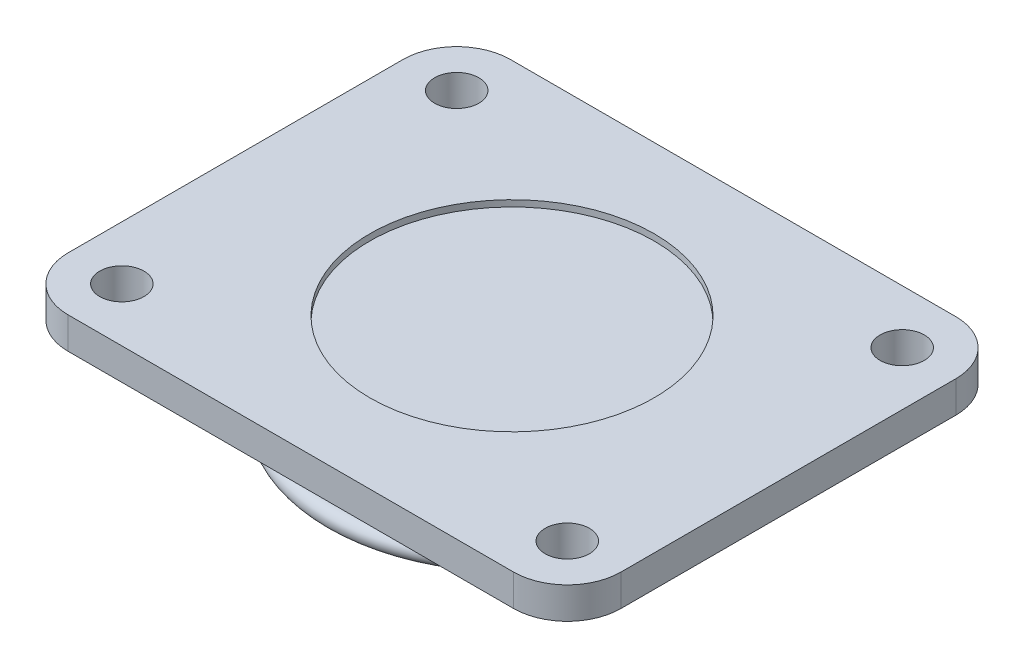
ISO-10303-21;
HEADER;
FILE_DESCRIPTION(('STEP AP214'),'2;1');
FILE_NAME('part.step','',(''),(''),'','','');
FILE_SCHEMA(('AUTOMOTIVE_DESIGN { 1 0 10303 214 1 1 1 1 }'));
ENDSEC;
DATA;
#1=APPLICATION_CONTEXT('core data for automotive mechanical design processes');
#2=APPLICATION_PROTOCOL_DEFINITION('international standard','automotive_design',2000,#1);
#3=PRODUCT_CONTEXT('',#1,'mechanical');
#4=PRODUCT('Part','Part','',(#3));
#5=PRODUCT_RELATED_PRODUCT_CATEGORY('part','',(#4));
#6=PRODUCT_DEFINITION_FORMATION('','',#4);
#7=PRODUCT_DEFINITION_CONTEXT('part definition',#1,'design');
#8=PRODUCT_DEFINITION('design','',#6,#7);
#9=PRODUCT_DEFINITION_SHAPE('','',#8);
#10=(LENGTH_UNIT() NAMED_UNIT(*) SI_UNIT(.MILLI.,.METRE.));
#11=(NAMED_UNIT(*) PLANE_ANGLE_UNIT() SI_UNIT($,.RADIAN.));
#12=(NAMED_UNIT(*) SI_UNIT($,.STERADIAN.) SOLID_ANGLE_UNIT());
#13=UNCERTAINTY_MEASURE_WITH_UNIT(LENGTH_MEASURE(1.E-05),#10,'distance_accuracy_value','');
#14=(GEOMETRIC_REPRESENTATION_CONTEXT(3) GLOBAL_UNCERTAINTY_ASSIGNED_CONTEXT((#13)) GLOBAL_UNIT_ASSIGNED_CONTEXT((#10,
#11,#12)) REPRESENTATION_CONTEXT('',''));
#15=CARTESIAN_POINT('',(0.,0.,0.));
#16=DIRECTION('',(0.,0.,1.));
#17=DIRECTION('',(1.,0.,0.));
#18=AXIS2_PLACEMENT_3D('',#15,#16,#17);
#19=CARTESIAN_POINT('',(-70.5,10.,53.));
#20=DIRECTION('',(0.,-1.,0.));
#21=DIRECTION('',(0.,0.,-1.));
#22=AXIS2_PLACEMENT_3D('',#19,#20,#21);
#23=PLANE('',#22);
#24=CARTESIAN_POINT('',(0.,10.,0.));
#25=DIRECTION('',(0.,1.,0.));
#26=DIRECTION('',(0.,0.,1.));
#27=AXIS2_PLACEMENT_3D('',#24,#25,#26);
#28=CIRCLE('',#27,45.);
#29=CARTESIAN_POINT('',(0.,10.,45.));
#30=VERTEX_POINT('',#29);
#31=EDGE_CURVE('E256',#30,#30,#28,.T.);
#32=ORIENTED_EDGE('',*,*,#31,.F.);
#33=EDGE_LOOP('',(#32));
#34=FACE_BOUND('',#33,.T.);
#35=CARTESIAN_POINT('',(-70.5,10.,53.));
#36=DIRECTION('',(0.,1.,0.));
#37=DIRECTION('',(0.,0.,-1.));
#38=AXIS2_PLACEMENT_3D('',#35,#36,#37);
#39=CIRCLE('',#38,17.);
#40=CARTESIAN_POINT('',(-87.5,10.,52.9999999999999));
#41=VERTEX_POINT('',#40);
#42=CARTESIAN_POINT('',(-70.4999999999999,10.,70.));
#43=VERTEX_POINT('',#42);
#44=EDGE_CURVE('E148',#41,#43,#39,.T.);
#45=ORIENTED_EDGE('',*,*,#44,.T.);
#46=DIRECTION('',(1.,0.,0.));
#47=VECTOR('',#46,1.);
#48=CARTESIAN_POINT('',(-70.4999999999999,10.,70.));
#49=LINE('',#48,#47);
#50=CARTESIAN_POINT('',(70.4999999999999,10.,70.));
#51=VERTEX_POINT('',#50);
#52=EDGE_CURVE('E96',#43,#51,#49,.T.);
#53=ORIENTED_EDGE('',*,*,#52,.T.);
#54=CARTESIAN_POINT('',(70.5,10.,53.));
#55=DIRECTION('',(0.,1.,0.));
#56=DIRECTION('',(0.,0.,1.));
#57=AXIS2_PLACEMENT_3D('',#54,#55,#56);
#58=CIRCLE('',#57,17.);
#59=CARTESIAN_POINT('',(87.5,10.,52.9999999999999));
#60=VERTEX_POINT('',#59);
#61=EDGE_CURVE('E224',#51,#60,#58,.T.);
#62=ORIENTED_EDGE('',*,*,#61,.T.);
#63=DIRECTION('',(0.,0.,-1.));
#64=VECTOR('',#63,1.);
#65=CARTESIAN_POINT('',(87.5,10.,52.9999999999999));
#66=LINE('',#65,#64);
#67=CARTESIAN_POINT('',(87.5,10.,-52.9999999999999));
#68=VERTEX_POINT('',#67);
#69=EDGE_CURVE('E226',#60,#68,#66,.T.);
#70=ORIENTED_EDGE('',*,*,#69,.T.);
#71=CARTESIAN_POINT('',(70.5,10.,-53.));
#72=DIRECTION('',(0.,1.,0.));
#73=DIRECTION('',(0.,0.,-1.));
#74=AXIS2_PLACEMENT_3D('',#71,#72,#73);
#75=CIRCLE('',#74,17.);
#76=CARTESIAN_POINT('',(70.4999999999999,10.,-70.));
#77=VERTEX_POINT('',#76);
#78=EDGE_CURVE('E115',#68,#77,#75,.T.);
#79=ORIENTED_EDGE('',*,*,#78,.T.);
#80=DIRECTION('',(-1.,0.,0.));
#81=VECTOR('',#80,1.);
#82=CARTESIAN_POINT('',(-70.4999999999999,10.,-70.));
#83=LINE('',#82,#81);
#84=CARTESIAN_POINT('',(-70.4999999999999,10.,-70.));
#85=VERTEX_POINT('',#84);
#86=EDGE_CURVE('E109',#77,#85,#83,.T.);
#87=ORIENTED_EDGE('',*,*,#86,.T.);
#88=CARTESIAN_POINT('',(-70.5,10.,-53.));
#89=DIRECTION('',(0.,1.,0.));
#90=DIRECTION('',(0.,0.,-1.));
#91=AXIS2_PLACEMENT_3D('',#88,#89,#90);
#92=CIRCLE('',#91,17.);
#93=CARTESIAN_POINT('',(-87.5,10.,-52.9999999999999));
#94=VERTEX_POINT('',#93);
#95=EDGE_CURVE('E113',#85,#94,#92,.T.);
#96=ORIENTED_EDGE('',*,*,#95,.T.);
#97=DIRECTION('',(0.,0.,1.));
#98=VECTOR('',#97,1.);
#99=CARTESIAN_POINT('',(-87.5,10.,52.9999999999999));
#100=LINE('',#99,#98);
#101=EDGE_CURVE('E52',#94,#41,#100,.T.);
#102=ORIENTED_EDGE('',*,*,#101,.T.);
#103=EDGE_LOOP('',(#45,#53,#62,#70,#79,#87,#96,#102));
#104=FACE_BOUND('',#103,.T.);
#105=CARTESIAN_POINT('',(70.5,10.,53.));
#106=DIRECTION('',(0.,1.,0.));
#107=DIRECTION('',(0.,0.,1.));
#108=AXIS2_PLACEMENT_3D('',#105,#106,#107);
#109=CIRCLE('',#108,7.);
#110=CARTESIAN_POINT('',(70.5,10.,60.));
#111=VERTEX_POINT('',#110);
#112=EDGE_CURVE('E137',#111,#111,#109,.T.);
#113=ORIENTED_EDGE('',*,*,#112,.F.);
#114=EDGE_LOOP('',(#113));
#115=FACE_BOUND('',#114,.T.);
#116=CARTESIAN_POINT('',(70.5,10.,-53.));
#117=DIRECTION('',(0.,1.,0.));
#118=DIRECTION('',(0.,0.,1.));
#119=AXIS2_PLACEMENT_3D('',#116,#117,#118);
#120=CIRCLE('',#119,7.);
#121=CARTESIAN_POINT('',(70.5,10.,-46.));
#122=VERTEX_POINT('',#121);
#123=EDGE_CURVE('E235',#122,#122,#120,.T.);
#124=ORIENTED_EDGE('',*,*,#123,.F.);
#125=EDGE_LOOP('',(#124));
#126=FACE_BOUND('',#125,.T.);
#127=CARTESIAN_POINT('',(-70.5,10.,-53.));
#128=DIRECTION('',(0.,1.,0.));
#129=DIRECTION('',(0.,0.,1.));
#130=AXIS2_PLACEMENT_3D('',#127,#128,#129);
#131=CIRCLE('',#130,7.);
#132=CARTESIAN_POINT('',(-70.5,10.,-46.));
#133=VERTEX_POINT('',#132);
#134=EDGE_CURVE('E241',#133,#133,#131,.T.);
#135=ORIENTED_EDGE('',*,*,#134,.F.);
#136=EDGE_LOOP('',(#135));
#137=FACE_BOUND('',#136,.T.);
#138=CARTESIAN_POINT('',(-70.5,10.,53.));
#139=DIRECTION('',(0.,1.,0.));
#140=DIRECTION('',(0.,0.,1.));
#141=AXIS2_PLACEMENT_3D('',#138,#139,#140);
#142=CIRCLE('',#141,7.);
#143=CARTESIAN_POINT('',(-70.5,10.,60.));
#144=VERTEX_POINT('',#143);
#145=EDGE_CURVE('E247',#144,#144,#142,.T.);
#146=ORIENTED_EDGE('',*,*,#145,.F.);
#147=EDGE_LOOP('',(#146));
#148=FACE_BOUND('',#147,.T.);
#149=ADVANCED_FACE('F35',(#34,#104,#115,#126,#137,#148),#23,.F.);
#150=CARTESIAN_POINT('',(-70.5,0.,53.));
#151=DIRECTION('',(0.,-1.,0.));
#152=DIRECTION('',(0.,0.,-1.));
#153=AXIS2_PLACEMENT_3D('',#150,#151,#152);
#154=PLANE('',#153);
#155=CARTESIAN_POINT('',(0.,0.,0.));
#156=DIRECTION('',(0.,-1.,0.));
#157=DIRECTION('',(0.,0.,-1.));
#158=AXIS2_PLACEMENT_3D('',#155,#156,#157);
#159=CIRCLE('',#158,56.);
#160=CARTESIAN_POINT('',(0.,0.,-56.));
#161=VERTEX_POINT('',#160);
#162=EDGE_CURVE('E259',#161,#161,#159,.T.);
#163=ORIENTED_EDGE('',*,*,#162,.F.);
#164=EDGE_LOOP('',(#163));
#165=FACE_BOUND('',#164,.T.);
#166=CARTESIAN_POINT('',(-70.5,0.,-53.));
#167=DIRECTION('',(0.,1.,0.));
#168=DIRECTION('',(0.,0.,1.));
#169=AXIS2_PLACEMENT_3D('',#166,#167,#168);
#170=CIRCLE('',#169,7.);
#171=CARTESIAN_POINT('',(-70.5,0.,-46.));
#172=VERTEX_POINT('',#171);
#173=EDGE_CURVE('E244',#172,#172,#170,.T.);
#174=ORIENTED_EDGE('',*,*,#173,.T.);
#175=EDGE_LOOP('',(#174));
#176=FACE_BOUND('',#175,.T.);
#177=CARTESIAN_POINT('',(70.5,0.,53.));
#178=DIRECTION('',(0.,1.,0.));
#179=DIRECTION('',(0.,0.,1.));
#180=AXIS2_PLACEMENT_3D('',#177,#178,#179);
#181=CIRCLE('',#180,7.);
#182=CARTESIAN_POINT('',(70.5,0.,60.));
#183=VERTEX_POINT('',#182);
#184=EDGE_CURVE('E232',#183,#183,#181,.T.);
#185=ORIENTED_EDGE('',*,*,#184,.T.);
#186=EDGE_LOOP('',(#185));
#187=FACE_BOUND('',#186,.T.);
#188=CARTESIAN_POINT('',(-70.5,0.,53.));
#189=DIRECTION('',(0.,1.,0.));
#190=DIRECTION('',(0.,0.,-1.));
#191=AXIS2_PLACEMENT_3D('',#188,#189,#190);
#192=CIRCLE('',#191,17.);
#193=CARTESIAN_POINT('',(-87.5,0.,52.9999999999999));
#194=VERTEX_POINT('',#193);
#195=CARTESIAN_POINT('',(-70.4999999999999,0.,70.));
#196=VERTEX_POINT('',#195);
#197=EDGE_CURVE('E133',#194,#196,#192,.T.);
#198=ORIENTED_EDGE('',*,*,#197,.F.);
#199=DIRECTION('',(0.,0.,1.));
#200=VECTOR('',#199,1.);
#201=CARTESIAN_POINT('',(-87.5,0.,52.9999999999999));
#202=LINE('',#201,#200);
#203=CARTESIAN_POINT('',(-87.5,0.,-52.9999999999999));
#204=VERTEX_POINT('',#203);
#205=EDGE_CURVE('E87',#204,#194,#202,.T.);
#206=ORIENTED_EDGE('',*,*,#205,.F.);
#207=CARTESIAN_POINT('',(-70.5,0.,-53.));
#208=DIRECTION('',(0.,1.,0.));
#209=DIRECTION('',(0.,0.,-1.));
#210=AXIS2_PLACEMENT_3D('',#207,#208,#209);
#211=CIRCLE('',#210,17.);
#212=CARTESIAN_POINT('',(-70.4999999999999,0.,-70.));
#213=VERTEX_POINT('',#212);
#214=EDGE_CURVE('E81',#213,#204,#211,.T.);
#215=ORIENTED_EDGE('',*,*,#214,.F.);
#216=DIRECTION('',(-1.,0.,0.));
#217=VECTOR('',#216,1.);
#218=CARTESIAN_POINT('',(-70.4999999999999,0.,-70.));
#219=LINE('',#218,#217);
#220=CARTESIAN_POINT('',(70.4999999999999,0.,-70.));
#221=VERTEX_POINT('',#220);
#222=EDGE_CURVE('E123',#221,#213,#219,.T.);
#223=ORIENTED_EDGE('',*,*,#222,.F.);
#224=CARTESIAN_POINT('',(70.5,0.,-53.));
#225=DIRECTION('',(0.,1.,0.));
#226=DIRECTION('',(0.,0.,-1.));
#227=AXIS2_PLACEMENT_3D('',#224,#225,#226);
#228=CIRCLE('',#227,17.);
#229=CARTESIAN_POINT('',(87.5,0.,-52.9999999999999));
#230=VERTEX_POINT('',#229);
#231=EDGE_CURVE('E143',#230,#221,#228,.T.);
#232=ORIENTED_EDGE('',*,*,#231,.F.);
#233=DIRECTION('',(0.,0.,-1.));
#234=VECTOR('',#233,1.);
#235=CARTESIAN_POINT('',(87.5,0.,52.9999999999999));
#236=LINE('',#235,#234);
#237=CARTESIAN_POINT('',(87.5,0.,52.9999999999999));
#238=VERTEX_POINT('',#237);
#239=EDGE_CURVE('E141',#238,#230,#236,.T.);
#240=ORIENTED_EDGE('',*,*,#239,.F.);
#241=CARTESIAN_POINT('',(70.5,0.,53.));
#242=DIRECTION('',(0.,1.,0.));
#243=DIRECTION('',(0.,0.,1.));
#244=AXIS2_PLACEMENT_3D('',#241,#242,#243);
#245=CIRCLE('',#244,17.);
#246=CARTESIAN_POINT('',(70.4999999999999,0.,70.));
#247=VERTEX_POINT('',#246);
#248=EDGE_CURVE('E139',#247,#238,#245,.T.);
#249=ORIENTED_EDGE('',*,*,#248,.F.);
#250=DIRECTION('',(1.,0.,0.));
#251=VECTOR('',#250,1.);
#252=CARTESIAN_POINT('',(-70.4999999999999,0.,70.));
#253=LINE('',#252,#251);
#254=EDGE_CURVE('E136',#196,#247,#253,.T.);
#255=ORIENTED_EDGE('',*,*,#254,.F.);
#256=EDGE_LOOP('',(#198,#206,#215,#223,#232,#240,#249,#255));
#257=FACE_BOUND('',#256,.T.);
#258=CARTESIAN_POINT('',(70.5,0.,-53.));
#259=DIRECTION('',(0.,1.,0.));
#260=DIRECTION('',(0.,0.,1.));
#261=AXIS2_PLACEMENT_3D('',#258,#259,#260);
#262=CIRCLE('',#261,7.);
#263=CARTESIAN_POINT('',(70.5,0.,-46.));
#264=VERTEX_POINT('',#263);
#265=EDGE_CURVE('E238',#264,#264,#262,.T.);
#266=ORIENTED_EDGE('',*,*,#265,.T.);
#267=EDGE_LOOP('',(#266));
#268=FACE_BOUND('',#267,.T.);
#269=CARTESIAN_POINT('',(-70.5,0.,53.));
#270=DIRECTION('',(0.,1.,0.));
#271=DIRECTION('',(0.,0.,1.));
#272=AXIS2_PLACEMENT_3D('',#269,#270,#271);
#273=CIRCLE('',#272,7.);
#274=CARTESIAN_POINT('',(-70.5,0.,60.));
#275=VERTEX_POINT('',#274);
#276=EDGE_CURVE('E250',#275,#275,#273,.T.);
#277=ORIENTED_EDGE('',*,*,#276,.T.);
#278=EDGE_LOOP('',(#277));
#279=FACE_BOUND('',#278,.T.);
#280=ADVANCED_FACE('F176',(#165,#176,#187,#257,#268,#279),#154,.T.);
#281=CARTESIAN_POINT('',(-70.5,10.,53.));
#282=DIRECTION('',(0.,-1.,0.));
#283=DIRECTION('',(0.,0.,-1.));
#284=AXIS2_PLACEMENT_3D('',#281,#282,#283);
#285=CYLINDRICAL_SURFACE('',#284,17.);
#286=ORIENTED_EDGE('',*,*,#197,.T.);
#287=DIRECTION('',(0.,-1.,0.));
#288=VECTOR('',#287,1.);
#289=CARTESIAN_POINT('',(-70.4999999999999,10.,70.));
#290=LINE('',#289,#288);
#291=EDGE_CURVE('E161',#43,#196,#290,.T.);
#292=ORIENTED_EDGE('',*,*,#291,.F.);
#293=ORIENTED_EDGE('',*,*,#44,.F.);
#294=DIRECTION('',(0.,-1.,0.));
#295=VECTOR('',#294,1.);
#296=CARTESIAN_POINT('',(-87.5,10.,52.9999999999999));
#297=LINE('',#296,#295);
#298=EDGE_CURVE('E129',#41,#194,#297,.T.);
#299=ORIENTED_EDGE('',*,*,#298,.T.);
#300=EDGE_LOOP('',(#286,#292,#293,#299));
#301=FACE_BOUND('',#300,.T.);
#302=ADVANCED_FACE('F182',(#301),#285,.T.);
#303=CARTESIAN_POINT('',(-70.4999999999999,10.,70.));
#304=DIRECTION('',(0.,0.,-1.));
#305=DIRECTION('',(-1.,0.,0.));
#306=AXIS2_PLACEMENT_3D('',#303,#304,#305);
#307=PLANE('',#306);
#308=ORIENTED_EDGE('',*,*,#254,.T.);
#309=DIRECTION('',(0.,-1.,0.));
#310=VECTOR('',#309,1.);
#311=CARTESIAN_POINT('',(70.4999999999999,10.,70.));
#312=LINE('',#311,#310);
#313=EDGE_CURVE('E158',#51,#247,#312,.T.);
#314=ORIENTED_EDGE('',*,*,#313,.F.);
#315=ORIENTED_EDGE('',*,*,#52,.F.);
#316=ORIENTED_EDGE('',*,*,#291,.T.);
#317=EDGE_LOOP('',(#308,#314,#315,#316));
#318=FACE_BOUND('',#317,.T.);
#319=ADVANCED_FACE('F208',(#318),#307,.F.);
#320=CARTESIAN_POINT('',(70.5,10.,53.));
#321=DIRECTION('',(0.,-1.,0.));
#322=DIRECTION('',(0.,0.,-1.));
#323=AXIS2_PLACEMENT_3D('',#320,#321,#322);
#324=CYLINDRICAL_SURFACE('',#323,17.);
#325=ORIENTED_EDGE('',*,*,#248,.T.);
#326=DIRECTION('',(0.,-1.,0.));
#327=VECTOR('',#326,1.);
#328=CARTESIAN_POINT('',(87.5,10.,52.9999999999999));
#329=LINE('',#328,#327);
#330=EDGE_CURVE('E155',#60,#238,#329,.T.);
#331=ORIENTED_EDGE('',*,*,#330,.F.);
#332=ORIENTED_EDGE('',*,*,#61,.F.);
#333=ORIENTED_EDGE('',*,*,#313,.T.);
#334=EDGE_LOOP('',(#325,#331,#332,#333));
#335=FACE_BOUND('',#334,.T.);
#336=ADVANCED_FACE('F204',(#335),#324,.T.);
#337=CARTESIAN_POINT('',(87.5,10.,52.9999999999999));
#338=DIRECTION('',(-1.,0.,0.));
#339=DIRECTION('',(0.,0.,1.));
#340=AXIS2_PLACEMENT_3D('',#337,#338,#339);
#341=PLANE('',#340);
#342=ORIENTED_EDGE('',*,*,#239,.T.);
#343=DIRECTION('',(0.,-1.,0.));
#344=VECTOR('',#343,1.);
#345=CARTESIAN_POINT('',(87.5,10.,-52.9999999999999));
#346=LINE('',#345,#344);
#347=EDGE_CURVE('E152',#68,#230,#346,.T.);
#348=ORIENTED_EDGE('',*,*,#347,.F.);
#349=ORIENTED_EDGE('',*,*,#69,.F.);
#350=ORIENTED_EDGE('',*,*,#330,.T.);
#351=EDGE_LOOP('',(#342,#348,#349,#350));
#352=FACE_BOUND('',#351,.T.);
#353=ADVANCED_FACE('F200',(#352),#341,.F.);
#354=CARTESIAN_POINT('',(70.5,10.,-53.));
#355=DIRECTION('',(0.,-1.,0.));
#356=DIRECTION('',(0.,0.,-1.));
#357=AXIS2_PLACEMENT_3D('',#354,#355,#356);
#358=CYLINDRICAL_SURFACE('',#357,17.);
#359=ORIENTED_EDGE('',*,*,#231,.T.);
#360=DIRECTION('',(0.,-1.,0.));
#361=VECTOR('',#360,1.);
#362=CARTESIAN_POINT('',(70.4999999999999,10.,-70.));
#363=LINE('',#362,#361);
#364=EDGE_CURVE('E124',#77,#221,#363,.T.);
#365=ORIENTED_EDGE('',*,*,#364,.F.);
#366=ORIENTED_EDGE('',*,*,#78,.F.);
#367=ORIENTED_EDGE('',*,*,#347,.T.);
#368=EDGE_LOOP('',(#359,#365,#366,#367));
#369=FACE_BOUND('',#368,.T.);
#370=ADVANCED_FACE('F197',(#369),#358,.T.);
#371=CARTESIAN_POINT('',(-70.4999999999999,10.,-70.));
#372=DIRECTION('',(0.,0.,1.));
#373=DIRECTION('',(1.,0.,0.));
#374=AXIS2_PLACEMENT_3D('',#371,#372,#373);
#375=PLANE('',#374);
#376=ORIENTED_EDGE('',*,*,#222,.T.);
#377=DIRECTION('',(0.,-1.,0.));
#378=VECTOR('',#377,1.);
#379=CARTESIAN_POINT('',(-70.4999999999999,10.,-70.));
#380=LINE('',#379,#378);
#381=EDGE_CURVE('E120',#85,#213,#380,.T.);
#382=ORIENTED_EDGE('',*,*,#381,.F.);
#383=ORIENTED_EDGE('',*,*,#86,.F.);
#384=ORIENTED_EDGE('',*,*,#364,.T.);
#385=EDGE_LOOP('',(#376,#382,#383,#384));
#386=FACE_BOUND('',#385,.T.);
#387=ADVANCED_FACE('F121',(#386),#375,.F.);
#388=CARTESIAN_POINT('',(-70.5,10.,-53.));
#389=DIRECTION('',(0.,-1.,0.));
#390=DIRECTION('',(0.,0.,-1.));
#391=AXIS2_PLACEMENT_3D('',#388,#389,#390);
#392=CYLINDRICAL_SURFACE('',#391,17.);
#393=ORIENTED_EDGE('',*,*,#214,.T.);
#394=DIRECTION('',(0.,-1.,0.));
#395=VECTOR('',#394,1.);
#396=CARTESIAN_POINT('',(-87.5,10.,-52.9999999999999));
#397=LINE('',#396,#395);
#398=EDGE_CURVE('E125',#94,#204,#397,.T.);
#399=ORIENTED_EDGE('',*,*,#398,.F.);
#400=ORIENTED_EDGE('',*,*,#95,.F.);
#401=ORIENTED_EDGE('',*,*,#381,.T.);
#402=EDGE_LOOP('',(#393,#399,#400,#401));
#403=FACE_BOUND('',#402,.T.);
#404=ADVANCED_FACE('F127',(#403),#392,.T.);
#405=CARTESIAN_POINT('',(-87.5,10.,52.9999999999999));
#406=DIRECTION('',(1.,0.,0.));
#407=DIRECTION('',(0.,0.,-1.));
#408=AXIS2_PLACEMENT_3D('',#405,#406,#407);
#409=PLANE('',#408);
#410=ORIENTED_EDGE('',*,*,#205,.T.);
#411=ORIENTED_EDGE('',*,*,#298,.F.);
#412=ORIENTED_EDGE('',*,*,#101,.F.);
#413=ORIENTED_EDGE('',*,*,#398,.T.);
#414=EDGE_LOOP('',(#410,#411,#412,#413));
#415=FACE_BOUND('',#414,.T.);
#416=ADVANCED_FACE('F190',(#415),#409,.F.);
#417=CARTESIAN_POINT('',(70.5,10.,53.));
#418=DIRECTION('',(0.,-1.,0.));
#419=DIRECTION('',(0.,0.,-1.));
#420=AXIS2_PLACEMENT_3D('',#417,#418,#419);
#421=CYLINDRICAL_SURFACE('',#420,7.);
#422=ORIENTED_EDGE('',*,*,#112,.T.);
#423=EDGE_LOOP('',(#422));
#424=FACE_BOUND('',#423,.T.);
#425=ORIENTED_EDGE('',*,*,#184,.F.);
#426=EDGE_LOOP('',(#425));
#427=FACE_BOUND('',#426,.T.);
#428=ADVANCED_FACE('F187',(#424,#427),#421,.F.);
#429=CARTESIAN_POINT('',(70.5,10.,-53.));
#430=DIRECTION('',(0.,-1.,0.));
#431=DIRECTION('',(0.,0.,-1.));
#432=AXIS2_PLACEMENT_3D('',#429,#430,#431);
#433=CYLINDRICAL_SURFACE('',#432,7.);
#434=ORIENTED_EDGE('',*,*,#123,.T.);
#435=EDGE_LOOP('',(#434));
#436=FACE_BOUND('',#435,.T.);
#437=ORIENTED_EDGE('',*,*,#265,.F.);
#438=EDGE_LOOP('',(#437));
#439=FACE_BOUND('',#438,.T.);
#440=ADVANCED_FACE('F299',(#436,#439),#433,.F.);
#441=CARTESIAN_POINT('',(-70.5,10.,-53.));
#442=DIRECTION('',(0.,-1.,0.));
#443=DIRECTION('',(0.,0.,-1.));
#444=AXIS2_PLACEMENT_3D('',#441,#442,#443);
#445=CYLINDRICAL_SURFACE('',#444,7.);
#446=ORIENTED_EDGE('',*,*,#134,.T.);
#447=EDGE_LOOP('',(#446));
#448=FACE_BOUND('',#447,.T.);
#449=ORIENTED_EDGE('',*,*,#173,.F.);
#450=EDGE_LOOP('',(#449));
#451=FACE_BOUND('',#450,.T.);
#452=ADVANCED_FACE('F304',(#448,#451),#445,.F.);
#453=CARTESIAN_POINT('',(-70.5,10.,53.));
#454=DIRECTION('',(0.,-1.,0.));
#455=DIRECTION('',(0.,0.,-1.));
#456=AXIS2_PLACEMENT_3D('',#453,#454,#455);
#457=CYLINDRICAL_SURFACE('',#456,7.);
#458=ORIENTED_EDGE('',*,*,#145,.T.);
#459=EDGE_LOOP('',(#458));
#460=FACE_BOUND('',#459,.T.);
#461=ORIENTED_EDGE('',*,*,#276,.F.);
#462=EDGE_LOOP('',(#461));
#463=FACE_BOUND('',#462,.T.);
#464=ADVANCED_FACE('F314',(#460,#463),#457,.F.);
#465=CARTESIAN_POINT('',(0.,8.,0.));
#466=DIRECTION('',(0.,1.,0.));
#467=DIRECTION('',(0.,0.,1.));
#468=AXIS2_PLACEMENT_3D('',#465,#466,#467);
#469=CYLINDRICAL_SURFACE('',#468,45.);
#470=CARTESIAN_POINT('',(0.,8.,0.));
#471=DIRECTION('',(0.,1.,0.));
#472=DIRECTION('',(0.,0.,1.));
#473=AXIS2_PLACEMENT_3D('',#470,#471,#472);
#474=CIRCLE('',#473,45.);
#475=CARTESIAN_POINT('',(0.,8.,45.));
#476=VERTEX_POINT('',#475);
#477=EDGE_CURVE('E253',#476,#476,#474,.T.);
#478=ORIENTED_EDGE('',*,*,#477,.F.);
#479=EDGE_LOOP('',(#478));
#480=FACE_BOUND('',#479,.T.);
#481=ORIENTED_EDGE('',*,*,#31,.T.);
#482=EDGE_LOOP('',(#481));
#483=FACE_BOUND('',#482,.T.);
#484=ADVANCED_FACE('F317',(#480,#483),#469,.F.);
#485=CARTESIAN_POINT('',(0.,8.,0.));
#486=DIRECTION('',(0.,1.,0.));
#487=DIRECTION('',(0.,0.,1.));
#488=AXIS2_PLACEMENT_3D('',#485,#486,#487);
#489=PLANE('',#488);
#490=ORIENTED_EDGE('',*,*,#477,.T.);
#491=EDGE_LOOP('',(#490));
#492=FACE_BOUND('',#491,.T.);
#493=ADVANCED_FACE('F290',(#492),#489,.T.);
#494=CARTESIAN_POINT('',(0.,-20.,0.));
#495=DIRECTION('',(0.,1.,0.));
#496=DIRECTION('',(0.,0.,1.));
#497=AXIS2_PLACEMENT_3D('',#494,#495,#496);
#498=CYLINDRICAL_SURFACE('',#497,56.);
#499=CARTESIAN_POINT('',(0.,-14.,0.));
#500=DIRECTION('',(0.,-1.,0.));
#501=DIRECTION('',(0.,0.,-1.));
#502=AXIS2_PLACEMENT_3D('',#499,#500,#501);
#503=CIRCLE('',#502,56.);
#504=CARTESIAN_POINT('',(0.,-14.,-56.));
#505=VERTEX_POINT('',#504);
#506=EDGE_CURVE('E264',#505,#505,#503,.F.);
#507=ORIENTED_EDGE('',*,*,#506,.T.);
#508=EDGE_LOOP('',(#507));
#509=FACE_BOUND('',#508,.T.);
#510=ORIENTED_EDGE('',*,*,#162,.T.);
#511=EDGE_LOOP('',(#510));
#512=FACE_BOUND('',#511,.T.);
#513=ADVANCED_FACE('F284',(#509,#512),#498,.T.);
#514=CARTESIAN_POINT('',(0.,-17.,0.));
#515=DIRECTION('',(0.,1.,0.));
#516=DIRECTION('',(0.,0.,1.));
#517=AXIS2_PLACEMENT_3D('',#514,#515,#516);
#518=TOROIDAL_SURFACE('',#517,56.,3.);
#519=CARTESIAN_POINT('',(0.,-20.,0.));
#520=DIRECTION('',(0.,1.,0.));
#521=DIRECTION('',(0.,0.,1.));
#522=AXIS2_PLACEMENT_3D('',#519,#520,#521);
#523=CIRCLE('',#522,56.);
#524=CARTESIAN_POINT('',(0.,-20.,56.));
#525=VERTEX_POINT('',#524);
#526=EDGE_CURVE('E267',#525,#525,#523,.T.);
#527=ORIENTED_EDGE('',*,*,#526,.T.);
#528=EDGE_LOOP('',(#527));
#529=FACE_BOUND('',#528,.T.);
#530=ORIENTED_EDGE('',*,*,#506,.F.);
#531=EDGE_LOOP('',(#530));
#532=FACE_BOUND('',#531,.T.);
#533=ADVANCED_FACE('F278',(#529,#532),#518,.T.);
#534=CARTESIAN_POINT('',(0.,-20.,0.));
#535=DIRECTION('',(0.,-1.,0.));
#536=DIRECTION('',(0.,0.,-1.));
#537=AXIS2_PLACEMENT_3D('',#534,#535,#536);
#538=PLANE('',#537);
#539=CARTESIAN_POINT('',(0.,-20.,0.));
#540=DIRECTION('',(0.,-1.,0.));
#541=DIRECTION('',(0.,0.,-1.));
#542=AXIS2_PLACEMENT_3D('',#539,#540,#541);
#543=CIRCLE('',#542,7.5);
#544=CARTESIAN_POINT('',(0.,-20.,-7.5));
#545=VERTEX_POINT('',#544);
#546=EDGE_CURVE('E270',#545,#545,#543,.T.);
#547=ORIENTED_EDGE('',*,*,#546,.F.);
#548=EDGE_LOOP('',(#547));
#549=FACE_BOUND('',#548,.T.);
#550=ORIENTED_EDGE('',*,*,#526,.F.);
#551=EDGE_LOOP('',(#550));
#552=FACE_BOUND('',#551,.T.);
#553=ADVANCED_FACE('F275',(#549,#552),#538,.T.);
#554=CARTESIAN_POINT('',(0.,-45.,0.));
#555=DIRECTION('',(0.,1.,0.));
#556=DIRECTION('',(0.,0.,1.));
#557=AXIS2_PLACEMENT_3D('',#554,#555,#556);
#558=CYLINDRICAL_SURFACE('',#557,7.5);
#559=CARTESIAN_POINT('',(0.,-44.,0.));
#560=DIRECTION('',(0.,-1.,0.));
#561=DIRECTION('',(0.,0.,-1.));
#562=AXIS2_PLACEMENT_3D('',#559,#560,#561);
#563=CIRCLE('',#562,7.5);
#564=CARTESIAN_POINT('',(0.,-44.,-7.5));
#565=VERTEX_POINT('',#564);
#566=EDGE_CURVE('E11',#565,#565,#563,.F.);
#567=ORIENTED_EDGE('',*,*,#566,.T.);
#568=EDGE_LOOP('',(#567));
#569=FACE_BOUND('',#568,.T.);
#570=ORIENTED_EDGE('',*,*,#546,.T.);
#571=EDGE_LOOP('',(#570));
#572=FACE_BOUND('',#571,.T.);
#573=ADVANCED_FACE('F172',(#569,#572),#558,.T.);
#574=CARTESIAN_POINT('',(0.,-45.,0.));
#575=DIRECTION('',(0.,-1.,0.));
#576=DIRECTION('',(0.,0.,-1.));
#577=AXIS2_PLACEMENT_3D('',#574,#575,#576);
#578=PLANE('',#577);
#579=CARTESIAN_POINT('',(0.,-45.,0.));
#580=DIRECTION('',(0.,-1.,0.));
#581=DIRECTION('',(0.,0.,-1.));
#582=AXIS2_PLACEMENT_3D('',#579,#580,#581);
#583=CIRCLE('',#582,6.50000000000001);
#584=CARTESIAN_POINT('',(0.,-45.,-6.50000000000001));
#585=VERTEX_POINT('',#584);
#586=EDGE_CURVE('E44',#585,#585,#583,.T.);
#587=ORIENTED_EDGE('',*,*,#586,.T.);
#588=EDGE_LOOP('',(#587));
#589=FACE_BOUND('',#588,.T.);
#590=ADVANCED_FACE('F165',(#589),#578,.T.);
#591=CARTESIAN_POINT('',(0.,-45.,0.));
#592=DIRECTION('',(0.,1.,0.));
#593=DIRECTION('',(0.,0.,1.));
#594=AXIS2_PLACEMENT_3D('',#591,#592,#593);
#595=CONICAL_SURFACE('',#594,6.50000000000001,0.785398163397435);
#596=ORIENTED_EDGE('',*,*,#566,.F.);
#597=EDGE_LOOP('',(#596));
#598=FACE_BOUND('',#597,.T.);
#599=ORIENTED_EDGE('',*,*,#586,.F.);
#600=EDGE_LOOP('',(#599));
#601=FACE_BOUND('',#600,.T.);
#602=ADVANCED_FACE('F37',(#598,#601),#595,.T.);
#603=CLOSED_SHELL('',(#149,#280,#302,#319,#336,#353,#370,#387,#404,#416,#428,#440,#452,#464,
#484,#493,#513,#533,#553,#573,#590,#602));
#604=MANIFOLD_SOLID_BREP('B2',#603);
#605=ADVANCED_BREP_SHAPE_REPRESENTATION('',(#18,#604),#14);
#606=SHAPE_DEFINITION_REPRESENTATION(#9,#605);
ENDSEC;
END-ISO-10303-21;
